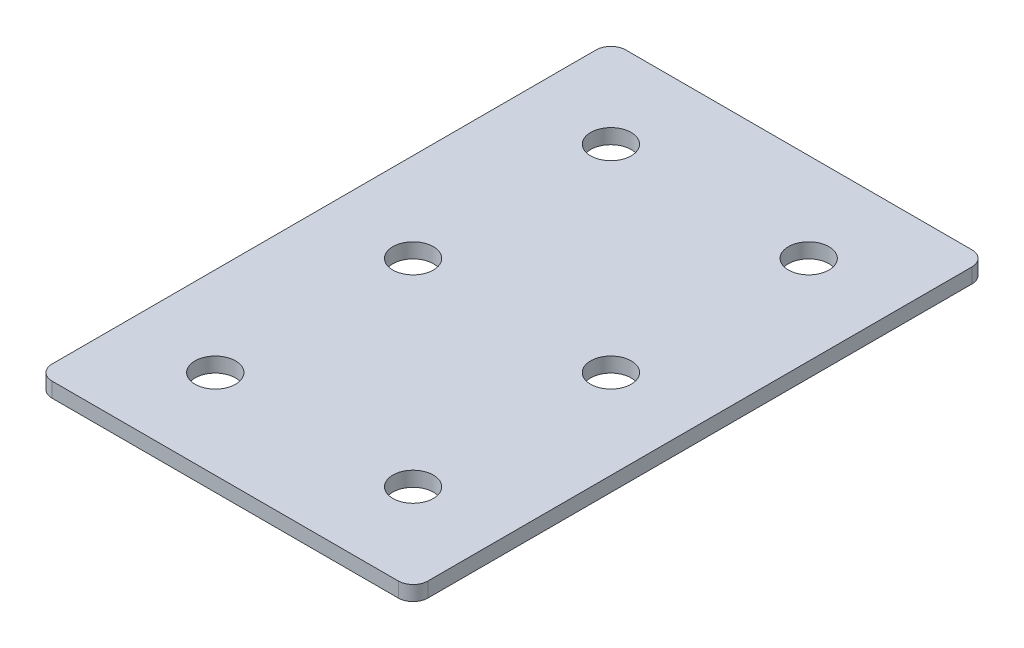
ISO-10303-21;
HEADER;
FILE_DESCRIPTION(('STEP AP214'),'2;1');
FILE_NAME('part.step','',(''),(''),'','','');
FILE_SCHEMA(('AUTOMOTIVE_DESIGN { 1 0 10303 214 1 1 1 1 }'));
ENDSEC;
DATA;
#1=APPLICATION_CONTEXT('core data for automotive mechanical design processes');
#2=APPLICATION_PROTOCOL_DEFINITION('international standard','automotive_design',2000,#1);
#3=PRODUCT_CONTEXT('',#1,'mechanical');
#4=PRODUCT('Part','Part','',(#3));
#5=PRODUCT_RELATED_PRODUCT_CATEGORY('part','',(#4));
#6=PRODUCT_DEFINITION_FORMATION('','',#4);
#7=PRODUCT_DEFINITION_CONTEXT('part definition',#1,'design');
#8=PRODUCT_DEFINITION('design','',#6,#7);
#9=PRODUCT_DEFINITION_SHAPE('','',#8);
#10=(LENGTH_UNIT() NAMED_UNIT(*) SI_UNIT(.MILLI.,.METRE.));
#11=(NAMED_UNIT(*) PLANE_ANGLE_UNIT() SI_UNIT($,.RADIAN.));
#12=(NAMED_UNIT(*) SI_UNIT($,.STERADIAN.) SOLID_ANGLE_UNIT());
#13=UNCERTAINTY_MEASURE_WITH_UNIT(LENGTH_MEASURE(1.E-05),#10,'distance_accuracy_value','');
#14=(GEOMETRIC_REPRESENTATION_CONTEXT(3) GLOBAL_UNCERTAINTY_ASSIGNED_CONTEXT((#13)) GLOBAL_UNIT_ASSIGNED_CONTEXT((#10,
#11,#12)) REPRESENTATION_CONTEXT('',''));
#15=CARTESIAN_POINT('',(0.,0.,0.));
#16=DIRECTION('',(0.,0.,1.));
#17=DIRECTION('',(1.,0.,0.));
#18=AXIS2_PLACEMENT_3D('',#15,#16,#17);
#19=CARTESIAN_POINT('',(-1.0203051665485,0.341431359764556,-40.8208269333067));
#20=DIRECTION('',(0.,-1.,0.));
#21=DIRECTION('',(0.,0.,-1.));
#22=AXIS2_PLACEMENT_3D('',#19,#20,#21);
#23=PLANE('',#22);
#24=CARTESIAN_POINT('',(18.9796948334515,0.341431359764556,39.1791730666933));
#25=DIRECTION('',(0.,1.,0.));
#26=DIRECTION('',(0.,0.,1.));
#27=AXIS2_PLACEMENT_3D('',#24,#25,#26);
#28=CIRCLE('',#27,4.1);
#29=CARTESIAN_POINT('',(18.9796948334515,0.341431359764556,43.2791730666933));
#30=VERTEX_POINT('',#29);
#31=EDGE_CURVE('E177',#30,#30,#28,.T.);
#32=ORIENTED_EDGE('',*,*,#31,.T.);
#33=EDGE_LOOP('',(#32));
#34=FACE_BOUND('',#33,.T.);
#35=CARTESIAN_POINT('',(-21.0203051665485,0.341431359764556,39.1791730666933));
#36=DIRECTION('',(0.,1.,0.));
#37=DIRECTION('',(0.,0.,1.));
#38=AXIS2_PLACEMENT_3D('',#35,#36,#37);
#39=CIRCLE('',#38,4.1);
#40=CARTESIAN_POINT('',(-21.0203051665485,0.341431359764556,43.2791730666933));
#41=VERTEX_POINT('',#40);
#42=EDGE_CURVE('E171',#41,#41,#39,.T.);
#43=ORIENTED_EDGE('',*,*,#42,.T.);
#44=EDGE_LOOP('',(#43));
#45=FACE_BOUND('',#44,.T.);
#46=CARTESIAN_POINT('',(18.9796948334515,0.341431359764556,-0.820826933306727));
#47=DIRECTION('',(0.,1.,0.));
#48=DIRECTION('',(0.,0.,1.));
#49=AXIS2_PLACEMENT_3D('',#46,#47,#48);
#50=CIRCLE('',#49,4.1);
#51=CARTESIAN_POINT('',(18.9796948334515,0.341431359764556,3.27917306669327));
#52=VERTEX_POINT('',#51);
#53=EDGE_CURVE('E165',#52,#52,#50,.T.);
#54=ORIENTED_EDGE('',*,*,#53,.T.);
#55=EDGE_LOOP('',(#54));
#56=FACE_BOUND('',#55,.T.);
#57=CARTESIAN_POINT('',(-21.0203051665485,0.341431359764556,-0.82082693330672));
#58=DIRECTION('',(0.,1.,0.));
#59=DIRECTION('',(0.,0.,1.));
#60=AXIS2_PLACEMENT_3D('',#57,#58,#59);
#61=CIRCLE('',#60,4.1);
#62=CARTESIAN_POINT('',(-21.0203051665485,0.341431359764556,3.27917306669328));
#63=VERTEX_POINT('',#62);
#64=EDGE_CURVE('E159',#63,#63,#61,.T.);
#65=ORIENTED_EDGE('',*,*,#64,.T.);
#66=EDGE_LOOP('',(#65));
#67=FACE_BOUND('',#66,.T.);
#68=CARTESIAN_POINT('',(18.9796948334515,0.341431359764556,-40.8208269333067));
#69=DIRECTION('',(0.,1.,0.));
#70=DIRECTION('',(0.,0.,1.));
#71=AXIS2_PLACEMENT_3D('',#68,#69,#70);
#72=CIRCLE('',#71,4.1);
#73=CARTESIAN_POINT('',(18.9796948334515,0.341431359764556,-36.7208269333067));
#74=VERTEX_POINT('',#73);
#75=EDGE_CURVE('E154',#74,#74,#72,.T.);
#76=ORIENTED_EDGE('',*,*,#75,.T.);
#77=EDGE_LOOP('',(#76));
#78=FACE_BOUND('',#77,.T.);
#79=CARTESIAN_POINT('',(-21.0203051665485,0.341431359764556,-40.8208269333067));
#80=DIRECTION('',(0.,1.,0.));
#81=DIRECTION('',(0.,0.,1.));
#82=AXIS2_PLACEMENT_3D('',#79,#80,#81);
#83=CIRCLE('',#82,4.1);
#84=CARTESIAN_POINT('',(-21.0203051665485,0.341431359764556,-36.7208269333067));
#85=VERTEX_POINT('',#84);
#86=EDGE_CURVE('E147',#85,#85,#83,.T.);
#87=ORIENTED_EDGE('',*,*,#86,.T.);
#88=EDGE_LOOP('',(#87));
#89=FACE_BOUND('',#88,.T.);
#90=DIRECTION('',(0.,0.,-1.));
#91=VECTOR('',#90,1.);
#92=CARTESIAN_POINT('',(36.9796948334516,0.341431359764556,57.1791730666932));
#93=LINE('',#92,#91);
#94=CARTESIAN_POINT('',(36.9796948334516,0.341431359764556,54.1791730666932));
#95=VERTEX_POINT('',#94);
#96=CARTESIAN_POINT('',(36.9796948334516,0.341431359764556,-55.8208269333067));
#97=VERTEX_POINT('',#96);
#98=EDGE_CURVE('E106',#95,#97,#93,.T.);
#99=ORIENTED_EDGE('',*,*,#98,.F.);
#100=CARTESIAN_POINT('',(33.9796948334516,0.341431359764556,54.1791730666932));
#101=DIRECTION('',(0.,-1.,0.));
#102=DIRECTION('',(0.,0.,-1.));
#103=AXIS2_PLACEMENT_3D('',#100,#101,#102);
#104=CIRCLE('',#103,3.);
#105=CARTESIAN_POINT('',(33.9796948334516,0.341431359764556,57.1791730666932));
#106=VERTEX_POINT('',#105);
#107=EDGE_CURVE('E128',#95,#106,#104,.T.);
#108=ORIENTED_EDGE('',*,*,#107,.T.);
#109=DIRECTION('',(1.,0.,0.));
#110=VECTOR('',#109,1.);
#111=CARTESIAN_POINT('',(-39.0203051665486,0.341431359764556,57.1791730666932));
#112=LINE('',#111,#110);
#113=CARTESIAN_POINT('',(-36.0203051665486,0.341431359764556,57.1791730666932));
#114=VERTEX_POINT('',#113);
#115=EDGE_CURVE('E110',#114,#106,#112,.T.);
#116=ORIENTED_EDGE('',*,*,#115,.F.);
#117=CARTESIAN_POINT('',(-36.0203051665486,0.341431359764556,54.1791730666932));
#118=DIRECTION('',(0.,-1.,0.));
#119=DIRECTION('',(0.,0.,-1.));
#120=AXIS2_PLACEMENT_3D('',#117,#118,#119);
#121=CIRCLE('',#120,3.);
#122=CARTESIAN_POINT('',(-39.0203051665486,0.341431359764556,54.1791730666932));
#123=VERTEX_POINT('',#122);
#124=EDGE_CURVE('E105',#114,#123,#121,.T.);
#125=ORIENTED_EDGE('',*,*,#124,.T.);
#126=DIRECTION('',(0.,0.,1.));
#127=VECTOR('',#126,1.);
#128=CARTESIAN_POINT('',(-39.0203051665486,0.341431359764556,-58.8208269333068));
#129=LINE('',#128,#127);
#130=CARTESIAN_POINT('',(-39.0203051665486,0.341431359764556,-55.8208269333068));
#131=VERTEX_POINT('',#130);
#132=EDGE_CURVE('E137',#131,#123,#129,.T.);
#133=ORIENTED_EDGE('',*,*,#132,.F.);
#134=CARTESIAN_POINT('',(-36.0203051665486,0.341431359764556,-55.8208269333068));
#135=DIRECTION('',(0.,-1.,0.));
#136=DIRECTION('',(0.,0.,-1.));
#137=AXIS2_PLACEMENT_3D('',#134,#135,#136);
#138=CIRCLE('',#137,3.);
#139=CARTESIAN_POINT('',(-36.0203051665486,0.341431359764556,-58.8208269333068));
#140=VERTEX_POINT('',#139);
#141=EDGE_CURVE('E31',#131,#140,#138,.T.);
#142=ORIENTED_EDGE('',*,*,#141,.T.);
#143=DIRECTION('',(-1.,0.,0.));
#144=VECTOR('',#143,1.);
#145=CARTESIAN_POINT('',(36.9796948334516,0.341431359764556,-58.8208269333068));
#146=LINE('',#145,#144);
#147=CARTESIAN_POINT('',(33.9796948334516,0.341431359764556,-58.8208269333068));
#148=VERTEX_POINT('',#147);
#149=EDGE_CURVE('E138',#148,#140,#146,.T.);
#150=ORIENTED_EDGE('',*,*,#149,.F.);
#151=CARTESIAN_POINT('',(33.9796948334516,0.341431359764556,-55.8208269333068));
#152=DIRECTION('',(0.,-1.,0.));
#153=DIRECTION('',(0.,0.,-1.));
#154=AXIS2_PLACEMENT_3D('',#151,#152,#153);
#155=CIRCLE('',#154,3.);
#156=EDGE_CURVE('E126',#148,#97,#155,.T.);
#157=ORIENTED_EDGE('',*,*,#156,.T.);
#158=EDGE_LOOP('',(#99,#108,#116,#125,#133,#142,#150,#157));
#159=FACE_BOUND('',#158,.T.);
#160=ADVANCED_FACE('F16',(#34,#45,#56,#67,#78,#89,#159),#23,.T.);
#161=CARTESIAN_POINT('',(36.9796948334516,0.341431359764556,-58.8208269333068));
#162=DIRECTION('',(0.,0.,-1.));
#163=DIRECTION('',(-1.,0.,0.));
#164=AXIS2_PLACEMENT_3D('',#161,#162,#163);
#165=PLANE('',#164);
#166=DIRECTION('',(-1.,0.,0.));
#167=VECTOR('',#166,1.);
#168=CARTESIAN_POINT('',(36.9796948334516,3.34143135976456,-58.8208269333068));
#169=LINE('',#168,#167);
#170=CARTESIAN_POINT('',(33.9796948334516,3.34143135976456,-58.8208269333068));
#171=VERTEX_POINT('',#170);
#172=CARTESIAN_POINT('',(-36.0203051665486,3.34143135976456,-58.8208269333068));
#173=VERTEX_POINT('',#172);
#174=EDGE_CURVE('E144',#171,#173,#169,.T.);
#175=ORIENTED_EDGE('',*,*,#174,.F.);
#176=DIRECTION('',(0.,1.,0.));
#177=VECTOR('',#176,1.);
#178=CARTESIAN_POINT('',(33.9796948334516,0.341431359764556,-58.8208269333068));
#179=LINE('',#178,#177);
#180=EDGE_CURVE('E38',#171,#148,#179,.F.);
#181=ORIENTED_EDGE('',*,*,#180,.T.);
#182=ORIENTED_EDGE('',*,*,#149,.T.);
#183=DIRECTION('',(0.,1.,0.));
#184=VECTOR('',#183,1.);
#185=CARTESIAN_POINT('',(-36.0203051665486,0.341431359764556,-58.8208269333068));
#186=LINE('',#185,#184);
#187=EDGE_CURVE('E130',#140,#173,#186,.T.);
#188=ORIENTED_EDGE('',*,*,#187,.T.);
#189=EDGE_LOOP('',(#175,#181,#182,#188));
#190=FACE_BOUND('',#189,.T.);
#191=ADVANCED_FACE('F223',(#190),#165,.T.);
#192=CARTESIAN_POINT('',(36.9796948334516,0.341431359764556,57.1791730666932));
#193=DIRECTION('',(1.,0.,0.));
#194=DIRECTION('',(0.,0.,-1.));
#195=AXIS2_PLACEMENT_3D('',#192,#193,#194);
#196=PLANE('',#195);
#197=DIRECTION('',(0.,0.,-1.));
#198=VECTOR('',#197,1.);
#199=CARTESIAN_POINT('',(36.9796948334516,3.34143135976456,57.1791730666932));
#200=LINE('',#199,#198);
#201=CARTESIAN_POINT('',(36.9796948334516,3.34143135976456,54.1791730666932));
#202=VERTEX_POINT('',#201);
#203=CARTESIAN_POINT('',(36.9796948334516,3.34143135976456,-55.8208269333067));
#204=VERTEX_POINT('',#203);
#205=EDGE_CURVE('E102',#202,#204,#200,.T.);
#206=ORIENTED_EDGE('',*,*,#205,.F.);
#207=DIRECTION('',(0.,1.,0.));
#208=VECTOR('',#207,1.);
#209=CARTESIAN_POINT('',(36.9796948334516,0.341431359764556,54.1791730666932));
#210=LINE('',#209,#208);
#211=EDGE_CURVE('E122',#202,#95,#210,.F.);
#212=ORIENTED_EDGE('',*,*,#211,.T.);
#213=ORIENTED_EDGE('',*,*,#98,.T.);
#214=DIRECTION('',(0.,1.,0.));
#215=VECTOR('',#214,1.);
#216=CARTESIAN_POINT('',(36.9796948334516,0.341431359764556,-55.8208269333068));
#217=LINE('',#216,#215);
#218=EDGE_CURVE('E119',#97,#204,#217,.T.);
#219=ORIENTED_EDGE('',*,*,#218,.T.);
#220=EDGE_LOOP('',(#206,#212,#213,#219));
#221=FACE_BOUND('',#220,.T.);
#222=ADVANCED_FACE('F228',(#221),#196,.T.);
#223=CARTESIAN_POINT('',(-39.0203051665486,0.341431359764556,57.1791730666932));
#224=DIRECTION('',(0.,0.,1.));
#225=DIRECTION('',(1.,0.,0.));
#226=AXIS2_PLACEMENT_3D('',#223,#224,#225);
#227=PLANE('',#226);
#228=ORIENTED_EDGE('',*,*,#115,.T.);
#229=DIRECTION('',(0.,1.,0.));
#230=VECTOR('',#229,1.);
#231=CARTESIAN_POINT('',(33.9796948334516,0.341431359764556,57.1791730666932));
#232=LINE('',#231,#230);
#233=CARTESIAN_POINT('',(33.9796948334516,3.34143135976456,57.1791730666932));
#234=VERTEX_POINT('',#233);
#235=EDGE_CURVE('E93',#106,#234,#232,.T.);
#236=ORIENTED_EDGE('',*,*,#235,.T.);
#237=DIRECTION('',(1.,0.,0.));
#238=VECTOR('',#237,1.);
#239=CARTESIAN_POINT('',(-39.0203051665486,3.34143135976456,57.1791730666932));
#240=LINE('',#239,#238);
#241=CARTESIAN_POINT('',(-36.0203051665486,3.34143135976456,57.1791730666932));
#242=VERTEX_POINT('',#241);
#243=EDGE_CURVE('E85',#242,#234,#240,.T.);
#244=ORIENTED_EDGE('',*,*,#243,.F.);
#245=DIRECTION('',(0.,1.,0.));
#246=VECTOR('',#245,1.);
#247=CARTESIAN_POINT('',(-36.0203051665486,0.341431359764556,57.1791730666932));
#248=LINE('',#247,#246);
#249=EDGE_CURVE('E99',#242,#114,#248,.F.);
#250=ORIENTED_EDGE('',*,*,#249,.T.);
#251=EDGE_LOOP('',(#228,#236,#244,#250));
#252=FACE_BOUND('',#251,.T.);
#253=ADVANCED_FACE('F98',(#252),#227,.T.);
#254=CARTESIAN_POINT('',(-39.0203051665486,0.341431359764556,-58.8208269333068));
#255=DIRECTION('',(-1.,0.,0.));
#256=DIRECTION('',(0.,0.,1.));
#257=AXIS2_PLACEMENT_3D('',#254,#255,#256);
#258=PLANE('',#257);
#259=DIRECTION('',(0.,0.,1.));
#260=VECTOR('',#259,1.);
#261=CARTESIAN_POINT('',(-39.0203051665486,3.34143135976456,-58.8208269333068));
#262=LINE('',#261,#260);
#263=CARTESIAN_POINT('',(-39.0203051665486,3.34143135976456,-55.8208269333068));
#264=VERTEX_POINT('',#263);
#265=CARTESIAN_POINT('',(-39.0203051665486,3.34143135976456,54.1791730666932));
#266=VERTEX_POINT('',#265);
#267=EDGE_CURVE('E87',#264,#266,#262,.T.);
#268=ORIENTED_EDGE('',*,*,#267,.F.);
#269=DIRECTION('',(0.,1.,0.));
#270=VECTOR('',#269,1.);
#271=CARTESIAN_POINT('',(-39.0203051665486,0.341431359764556,-55.8208269333068));
#272=LINE('',#271,#270);
#273=EDGE_CURVE('E10',#264,#131,#272,.F.);
#274=ORIENTED_EDGE('',*,*,#273,.T.);
#275=ORIENTED_EDGE('',*,*,#132,.T.);
#276=DIRECTION('',(0.,1.,0.));
#277=VECTOR('',#276,1.);
#278=CARTESIAN_POINT('',(-39.0203051665486,0.341431359764556,54.1791730666932));
#279=LINE('',#278,#277);
#280=EDGE_CURVE('E24',#123,#266,#279,.T.);
#281=ORIENTED_EDGE('',*,*,#280,.T.);
#282=EDGE_LOOP('',(#268,#274,#275,#281));
#283=FACE_BOUND('',#282,.T.);
#284=ADVANCED_FACE('F135',(#283),#258,.T.);
#285=CARTESIAN_POINT('',(-1.0203051665485,3.34143135976456,-40.8208269333067));
#286=DIRECTION('',(0.,-1.,0.));
#287=DIRECTION('',(0.,0.,-1.));
#288=AXIS2_PLACEMENT_3D('',#285,#286,#287);
#289=PLANE('',#288);
#290=CARTESIAN_POINT('',(18.9796948334515,3.34143135976456,39.1791730666933));
#291=DIRECTION('',(0.,1.,0.));
#292=DIRECTION('',(0.,0.,1.));
#293=AXIS2_PLACEMENT_3D('',#290,#291,#292);
#294=CIRCLE('',#293,4.1);
#295=CARTESIAN_POINT('',(18.9796948334515,3.34143135976456,43.2791730666933));
#296=VERTEX_POINT('',#295);
#297=EDGE_CURVE('E180',#296,#296,#294,.T.);
#298=ORIENTED_EDGE('',*,*,#297,.F.);
#299=EDGE_LOOP('',(#298));
#300=FACE_BOUND('',#299,.T.);
#301=CARTESIAN_POINT('',(-21.0203051665485,3.34143135976456,39.1791730666933));
#302=DIRECTION('',(0.,1.,0.));
#303=DIRECTION('',(0.,0.,1.));
#304=AXIS2_PLACEMENT_3D('',#301,#302,#303);
#305=CIRCLE('',#304,4.1);
#306=CARTESIAN_POINT('',(-21.0203051665485,3.34143135976456,43.2791730666933));
#307=VERTEX_POINT('',#306);
#308=EDGE_CURVE('E174',#307,#307,#305,.T.);
#309=ORIENTED_EDGE('',*,*,#308,.F.);
#310=EDGE_LOOP('',(#309));
#311=FACE_BOUND('',#310,.T.);
#312=CARTESIAN_POINT('',(18.9796948334515,3.34143135976456,-0.820826933306727));
#313=DIRECTION('',(0.,1.,0.));
#314=DIRECTION('',(0.,0.,1.));
#315=AXIS2_PLACEMENT_3D('',#312,#313,#314);
#316=CIRCLE('',#315,4.1);
#317=CARTESIAN_POINT('',(18.9796948334515,3.34143135976456,3.27917306669327));
#318=VERTEX_POINT('',#317);
#319=EDGE_CURVE('E168',#318,#318,#316,.T.);
#320=ORIENTED_EDGE('',*,*,#319,.F.);
#321=EDGE_LOOP('',(#320));
#322=FACE_BOUND('',#321,.T.);
#323=CARTESIAN_POINT('',(-21.0203051665485,3.34143135976456,-0.82082693330672));
#324=DIRECTION('',(0.,1.,0.));
#325=DIRECTION('',(0.,0.,1.));
#326=AXIS2_PLACEMENT_3D('',#323,#324,#325);
#327=CIRCLE('',#326,4.1);
#328=CARTESIAN_POINT('',(-21.0203051665485,3.34143135976456,3.27917306669328));
#329=VERTEX_POINT('',#328);
#330=EDGE_CURVE('E162',#329,#329,#327,.T.);
#331=ORIENTED_EDGE('',*,*,#330,.F.);
#332=EDGE_LOOP('',(#331));
#333=FACE_BOUND('',#332,.T.);
#334=CARTESIAN_POINT('',(18.9796948334515,3.34143135976456,-40.8208269333067));
#335=DIRECTION('',(0.,1.,0.));
#336=DIRECTION('',(0.,0.,1.));
#337=AXIS2_PLACEMENT_3D('',#334,#335,#336);
#338=CIRCLE('',#337,4.1);
#339=CARTESIAN_POINT('',(18.9796948334515,3.34143135976456,-36.7208269333067));
#340=VERTEX_POINT('',#339);
#341=EDGE_CURVE('E156',#340,#340,#338,.T.);
#342=ORIENTED_EDGE('',*,*,#341,.F.);
#343=EDGE_LOOP('',(#342));
#344=FACE_BOUND('',#343,.T.);
#345=CARTESIAN_POINT('',(-21.0203051665485,3.34143135976456,-40.8208269333067));
#346=DIRECTION('',(0.,1.,0.));
#347=DIRECTION('',(0.,0.,1.));
#348=AXIS2_PLACEMENT_3D('',#345,#346,#347);
#349=CIRCLE('',#348,4.1);
#350=CARTESIAN_POINT('',(-21.0203051665485,3.34143135976456,-36.7208269333067));
#351=VERTEX_POINT('',#350);
#352=EDGE_CURVE('E149',#351,#351,#349,.T.);
#353=ORIENTED_EDGE('',*,*,#352,.F.);
#354=EDGE_LOOP('',(#353));
#355=FACE_BOUND('',#354,.T.);
#356=ORIENTED_EDGE('',*,*,#243,.T.);
#357=CARTESIAN_POINT('',(33.9796948334516,3.34143135976456,54.1791730666932));
#358=DIRECTION('',(0.,-1.,0.));
#359=DIRECTION('',(0.,0.,-1.));
#360=AXIS2_PLACEMENT_3D('',#357,#358,#359);
#361=CIRCLE('',#360,3.);
#362=EDGE_CURVE('E117',#234,#202,#361,.F.);
#363=ORIENTED_EDGE('',*,*,#362,.T.);
#364=ORIENTED_EDGE('',*,*,#205,.T.);
#365=CARTESIAN_POINT('',(33.9796948334516,3.34143135976456,-55.8208269333068));
#366=DIRECTION('',(0.,-1.,0.));
#367=DIRECTION('',(0.,0.,-1.));
#368=AXIS2_PLACEMENT_3D('',#365,#366,#367);
#369=CIRCLE('',#368,3.);
#370=EDGE_CURVE('E115',#204,#171,#369,.F.);
#371=ORIENTED_EDGE('',*,*,#370,.T.);
#372=ORIENTED_EDGE('',*,*,#174,.T.);
#373=CARTESIAN_POINT('',(-36.0203051665486,3.34143135976456,-55.8208269333068));
#374=DIRECTION('',(0.,-1.,0.));
#375=DIRECTION('',(0.,0.,-1.));
#376=AXIS2_PLACEMENT_3D('',#373,#374,#375);
#377=CIRCLE('',#376,3.);
#378=EDGE_CURVE('E92',#173,#264,#377,.F.);
#379=ORIENTED_EDGE('',*,*,#378,.T.);
#380=ORIENTED_EDGE('',*,*,#267,.T.);
#381=CARTESIAN_POINT('',(-36.0203051665486,3.34143135976456,54.1791730666932));
#382=DIRECTION('',(0.,-1.,0.));
#383=DIRECTION('',(0.,0.,-1.));
#384=AXIS2_PLACEMENT_3D('',#381,#382,#383);
#385=CIRCLE('',#384,3.);
#386=EDGE_CURVE('E82',#266,#242,#385,.F.);
#387=ORIENTED_EDGE('',*,*,#386,.T.);
#388=EDGE_LOOP('',(#356,#363,#364,#371,#372,#379,#380,#387));
#389=FACE_BOUND('',#388,.T.);
#390=ADVANCED_FACE('F84',(#300,#311,#322,#333,#344,#355,#389),#289,.F.);
#391=CARTESIAN_POINT('',(-21.0203051665485,0.341431359764556,-40.8208269333067));
#392=DIRECTION('',(0.,1.,0.));
#393=DIRECTION('',(0.,0.,1.));
#394=AXIS2_PLACEMENT_3D('',#391,#392,#393);
#395=CYLINDRICAL_SURFACE('',#394,4.1);
#396=ORIENTED_EDGE('',*,*,#86,.F.);
#397=EDGE_LOOP('',(#396));
#398=FACE_BOUND('',#397,.T.);
#399=ORIENTED_EDGE('',*,*,#352,.T.);
#400=EDGE_LOOP('',(#399));
#401=FACE_BOUND('',#400,.T.);
#402=ADVANCED_FACE('F198',(#398,#401),#395,.F.);
#403=CARTESIAN_POINT('',(18.9796948334515,0.341431359764556,-40.8208269333067));
#404=DIRECTION('',(0.,1.,0.));
#405=DIRECTION('',(0.,0.,1.));
#406=AXIS2_PLACEMENT_3D('',#403,#404,#405);
#407=CYLINDRICAL_SURFACE('',#406,4.1);
#408=ORIENTED_EDGE('',*,*,#75,.F.);
#409=EDGE_LOOP('',(#408));
#410=FACE_BOUND('',#409,.T.);
#411=ORIENTED_EDGE('',*,*,#341,.T.);
#412=EDGE_LOOP('',(#411));
#413=FACE_BOUND('',#412,.T.);
#414=ADVANCED_FACE('F211',(#410,#413),#407,.F.);
#415=CARTESIAN_POINT('',(-21.0203051665485,0.341431359764556,-0.82082693330672));
#416=DIRECTION('',(0.,1.,0.));
#417=DIRECTION('',(0.,0.,1.));
#418=AXIS2_PLACEMENT_3D('',#415,#416,#417);
#419=CYLINDRICAL_SURFACE('',#418,4.1);
#420=ORIENTED_EDGE('',*,*,#64,.F.);
#421=EDGE_LOOP('',(#420));
#422=FACE_BOUND('',#421,.T.);
#423=ORIENTED_EDGE('',*,*,#330,.T.);
#424=EDGE_LOOP('',(#423));
#425=FACE_BOUND('',#424,.T.);
#426=ADVANCED_FACE('F218',(#422,#425),#419,.F.);
#427=CARTESIAN_POINT('',(18.9796948334515,0.341431359764556,-0.820826933306727));
#428=DIRECTION('',(0.,1.,0.));
#429=DIRECTION('',(0.,0.,1.));
#430=AXIS2_PLACEMENT_3D('',#427,#428,#429);
#431=CYLINDRICAL_SURFACE('',#430,4.1);
#432=ORIENTED_EDGE('',*,*,#53,.F.);
#433=EDGE_LOOP('',(#432));
#434=FACE_BOUND('',#433,.T.);
#435=ORIENTED_EDGE('',*,*,#319,.T.);
#436=EDGE_LOOP('',(#435));
#437=FACE_BOUND('',#436,.T.);
#438=ADVANCED_FACE('F291',(#434,#437),#431,.F.);
#439=CARTESIAN_POINT('',(-21.0203051665485,0.341431359764556,39.1791730666933));
#440=DIRECTION('',(0.,1.,0.));
#441=DIRECTION('',(0.,0.,1.));
#442=AXIS2_PLACEMENT_3D('',#439,#440,#441);
#443=CYLINDRICAL_SURFACE('',#442,4.1);
#444=ORIENTED_EDGE('',*,*,#42,.F.);
#445=EDGE_LOOP('',(#444));
#446=FACE_BOUND('',#445,.T.);
#447=ORIENTED_EDGE('',*,*,#308,.T.);
#448=EDGE_LOOP('',(#447));
#449=FACE_BOUND('',#448,.T.);
#450=ADVANCED_FACE('F192',(#446,#449),#443,.F.);
#451=CARTESIAN_POINT('',(18.9796948334515,0.341431359764556,39.1791730666933));
#452=DIRECTION('',(0.,1.,0.));
#453=DIRECTION('',(0.,0.,1.));
#454=AXIS2_PLACEMENT_3D('',#451,#452,#453);
#455=CYLINDRICAL_SURFACE('',#454,4.1);
#456=ORIENTED_EDGE('',*,*,#31,.F.);
#457=EDGE_LOOP('',(#456));
#458=FACE_BOUND('',#457,.T.);
#459=ORIENTED_EDGE('',*,*,#297,.T.);
#460=EDGE_LOOP('',(#459));
#461=FACE_BOUND('',#460,.T.);
#462=ADVANCED_FACE('F188',(#458,#461),#455,.F.);
#463=CARTESIAN_POINT('',(33.9796948334516,0.341431359764556,54.1791730666932));
#464=DIRECTION('',(0.,1.,0.));
#465=DIRECTION('',(0.,0.,1.));
#466=AXIS2_PLACEMENT_3D('',#463,#464,#465);
#467=CYLINDRICAL_SURFACE('',#466,3.);
#468=ORIENTED_EDGE('',*,*,#107,.F.);
#469=ORIENTED_EDGE('',*,*,#211,.F.);
#470=ORIENTED_EDGE('',*,*,#362,.F.);
#471=ORIENTED_EDGE('',*,*,#235,.F.);
#472=EDGE_LOOP('',(#468,#469,#470,#471));
#473=FACE_BOUND('',#472,.T.);
#474=ADVANCED_FACE('F191',(#473),#467,.T.);
#475=CARTESIAN_POINT('',(33.9796948334516,0.341431359764556,-55.8208269333068));
#476=DIRECTION('',(0.,1.,0.));
#477=DIRECTION('',(0.,0.,1.));
#478=AXIS2_PLACEMENT_3D('',#475,#476,#477);
#479=CYLINDRICAL_SURFACE('',#478,3.);
#480=ORIENTED_EDGE('',*,*,#156,.F.);
#481=ORIENTED_EDGE('',*,*,#180,.F.);
#482=ORIENTED_EDGE('',*,*,#370,.F.);
#483=ORIENTED_EDGE('',*,*,#218,.F.);
#484=EDGE_LOOP('',(#480,#481,#482,#483));
#485=FACE_BOUND('',#484,.T.);
#486=ADVANCED_FACE('F233',(#485),#479,.T.);
#487=CARTESIAN_POINT('',(-36.0203051665486,0.341431359764556,-55.8208269333068));
#488=DIRECTION('',(0.,1.,0.));
#489=DIRECTION('',(0.,0.,1.));
#490=AXIS2_PLACEMENT_3D('',#487,#488,#489);
#491=CYLINDRICAL_SURFACE('',#490,3.);
#492=ORIENTED_EDGE('',*,*,#141,.F.);
#493=ORIENTED_EDGE('',*,*,#273,.F.);
#494=ORIENTED_EDGE('',*,*,#378,.F.);
#495=ORIENTED_EDGE('',*,*,#187,.F.);
#496=EDGE_LOOP('',(#492,#493,#494,#495));
#497=FACE_BOUND('',#496,.T.);
#498=ADVANCED_FACE('F236',(#497),#491,.T.);
#499=CARTESIAN_POINT('',(-36.0203051665486,0.341431359764556,54.1791730666932));
#500=DIRECTION('',(0.,1.,0.));
#501=DIRECTION('',(0.,0.,1.));
#502=AXIS2_PLACEMENT_3D('',#499,#500,#501);
#503=CYLINDRICAL_SURFACE('',#502,3.);
#504=ORIENTED_EDGE('',*,*,#124,.F.);
#505=ORIENTED_EDGE('',*,*,#249,.F.);
#506=ORIENTED_EDGE('',*,*,#386,.F.);
#507=ORIENTED_EDGE('',*,*,#280,.F.);
#508=EDGE_LOOP('',(#504,#505,#506,#507));
#509=FACE_BOUND('',#508,.T.);
#510=ADVANCED_FACE('F18',(#509),#503,.T.);
#511=CLOSED_SHELL('',(#160,#191,#222,#253,#284,#390,#402,#414,#426,#438,#450,#462,#474,#486,
#498,#510));
#512=MANIFOLD_SOLID_BREP('B1',#511);
#513=ADVANCED_BREP_SHAPE_REPRESENTATION('',(#18,#512),#14);
#514=SHAPE_DEFINITION_REPRESENTATION(#9,#513);
ENDSEC;
END-ISO-10303-21;
